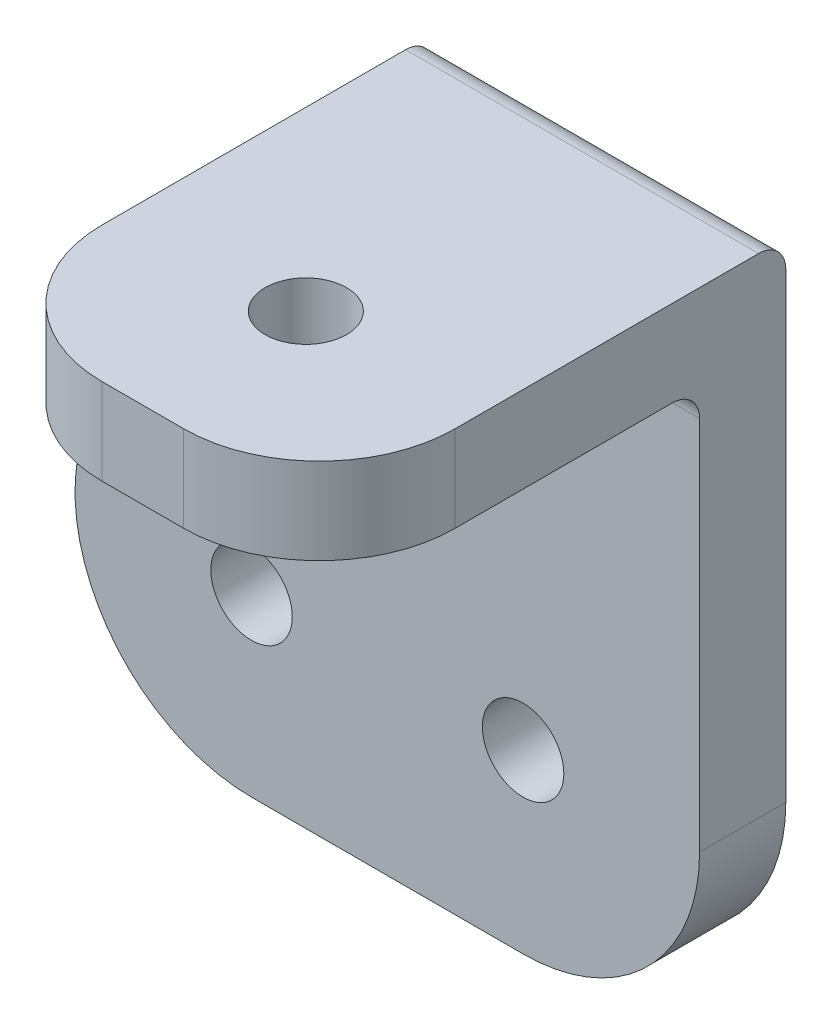
ISO-10303-21;
HEADER;
FILE_DESCRIPTION(('STEP AP214'),'2;1');
FILE_NAME('part.step','',(''),(''),'','','');
FILE_SCHEMA(('AUTOMOTIVE_DESIGN { 1 0 10303 214 1 1 1 1 }'));
ENDSEC;
DATA;
#1=APPLICATION_CONTEXT('core data for automotive mechanical design processes');
#2=APPLICATION_PROTOCOL_DEFINITION('international standard','automotive_design',2000,#1);
#3=PRODUCT_CONTEXT('',#1,'mechanical');
#4=PRODUCT('Part','Part','',(#3));
#5=PRODUCT_RELATED_PRODUCT_CATEGORY('part','',(#4));
#6=PRODUCT_DEFINITION_FORMATION('','',#4);
#7=PRODUCT_DEFINITION_CONTEXT('part definition',#1,'design');
#8=PRODUCT_DEFINITION('design','',#6,#7);
#9=PRODUCT_DEFINITION_SHAPE('','',#8);
#10=(LENGTH_UNIT() NAMED_UNIT(*) SI_UNIT(.MILLI.,.METRE.));
#11=(NAMED_UNIT(*) PLANE_ANGLE_UNIT() SI_UNIT($,.RADIAN.));
#12=(NAMED_UNIT(*) SI_UNIT($,.STERADIAN.) SOLID_ANGLE_UNIT());
#13=UNCERTAINTY_MEASURE_WITH_UNIT(LENGTH_MEASURE(1.E-05),#10,'distance_accuracy_value','');
#14=(GEOMETRIC_REPRESENTATION_CONTEXT(3) GLOBAL_UNCERTAINTY_ASSIGNED_CONTEXT((#13)) GLOBAL_UNIT_ASSIGNED_CONTEXT((#10,
#11,#12)) REPRESENTATION_CONTEXT('',''));
#15=CARTESIAN_POINT('',(0.,0.,0.));
#16=DIRECTION('',(0.,0.,1.));
#17=DIRECTION('',(1.,0.,0.));
#18=AXIS2_PLACEMENT_3D('',#15,#16,#17);
#19=CARTESIAN_POINT('',(0.,0.,3.175));
#20=DIRECTION('',(0.,0.,-1.));
#21=DIRECTION('',(-1.,0.,0.));
#22=AXIS2_PLACEMENT_3D('',#19,#20,#21);
#23=CYLINDRICAL_SURFACE('',#22,6.5);
#24=CARTESIAN_POINT('',(0.,0.,3.175));
#25=DIRECTION('',(0.,0.,1.));
#26=DIRECTION('',(1.,0.,0.));
#27=AXIS2_PLACEMENT_3D('',#24,#25,#26);
#28=CIRCLE('',#27,6.5);
#29=CARTESIAN_POINT('',(0.,-6.5,3.175));
#30=VERTEX_POINT('',#29);
#31=CARTESIAN_POINT('',(6.5,0.,3.175));
#32=VERTEX_POINT('',#31);
#33=EDGE_CURVE('E155',#30,#32,#28,.T.);
#34=ORIENTED_EDGE('',*,*,#33,.F.);
#35=DIRECTION('',(0.,0.,-1.));
#36=VECTOR('',#35,1.);
#37=CARTESIAN_POINT('',(0.,-6.5,24.1809515376));
#38=LINE('',#37,#36);
#39=CARTESIAN_POINT('',(0.,-6.5,0.));
#40=VERTEX_POINT('',#39);
#41=EDGE_CURVE('E139',#30,#40,#38,.T.);
#42=ORIENTED_EDGE('',*,*,#41,.T.);
#43=CARTESIAN_POINT('',(0.,0.,0.));
#44=DIRECTION('',(0.,0.,1.));
#45=DIRECTION('',(1.,0.,0.));
#46=AXIS2_PLACEMENT_3D('',#43,#44,#45);
#47=CIRCLE('',#46,6.5);
#48=CARTESIAN_POINT('',(6.5,0.,0.));
#49=VERTEX_POINT('',#48);
#50=EDGE_CURVE('E152',#40,#49,#47,.T.);
#51=ORIENTED_EDGE('',*,*,#50,.T.);
#52=DIRECTION('',(0.,0.,-1.));
#53=VECTOR('',#52,1.);
#54=CARTESIAN_POINT('',(6.5,0.,3.175));
#55=LINE('',#54,#53);
#56=EDGE_CURVE('E188',#32,#49,#55,.T.);
#57=ORIENTED_EDGE('',*,*,#56,.F.);
#58=EDGE_LOOP('',(#34,#42,#51,#57));
#59=FACE_BOUND('',#58,.T.);
#60=ADVANCED_FACE('F41',(#59),#23,.T.);
#61=CARTESIAN_POINT('',(6.5,0.,3.175));
#62=DIRECTION('',(1.,0.,0.));
#63=DIRECTION('',(0.,0.,-1.));
#64=AXIS2_PLACEMENT_3D('',#61,#62,#63);
#65=PLANE('',#64);
#66=DIRECTION('',(0.,-1.,0.));
#67=VECTOR('',#66,1.);
#68=CARTESIAN_POINT('',(6.5,0.,0.));
#69=LINE('',#68,#67);
#70=CARTESIAN_POINT('',(6.5,17.,0.));
#71=VERTEX_POINT('',#70);
#72=EDGE_CURVE('E163',#71,#49,#69,.T.);
#73=ORIENTED_EDGE('',*,*,#72,.F.);
#74=CARTESIAN_POINT('',(6.5,17.,1.));
#75=DIRECTION('',(1.,0.,0.));
#76=DIRECTION('',(0.,0.,-1.));
#77=AXIS2_PLACEMENT_3D('',#74,#75,#76);
#78=CIRCLE('',#77,1.);
#79=CARTESIAN_POINT('',(6.5,18.,1.));
#80=VERTEX_POINT('',#79);
#81=EDGE_CURVE('E226',#71,#80,#78,.T.);
#82=ORIENTED_EDGE('',*,*,#81,.T.);
#83=DIRECTION('',(0.,0.,-1.));
#84=VECTOR('',#83,1.);
#85=CARTESIAN_POINT('',(6.5,18.,3.175));
#86=LINE('',#85,#84);
#87=CARTESIAN_POINT('',(6.5,18.,12.175));
#88=VERTEX_POINT('',#87);
#89=EDGE_CURVE('E183',#88,#80,#86,.T.);
#90=ORIENTED_EDGE('',*,*,#89,.F.);
#91=DIRECTION('',(0.,1.,0.));
#92=VECTOR('',#91,1.);
#93=CARTESIAN_POINT('',(6.5,0.,12.175));
#94=LINE('',#93,#92);
#95=CARTESIAN_POINT('',(6.5,14.825,12.175));
#96=VERTEX_POINT('',#95);
#97=EDGE_CURVE('E220',#88,#96,#94,.F.);
#98=ORIENTED_EDGE('',*,*,#97,.T.);
#99=DIRECTION('',(0.,0.,-1.));
#100=VECTOR('',#99,1.);
#101=CARTESIAN_POINT('',(6.5,14.825,17.175));
#102=LINE('',#101,#100);
#103=CARTESIAN_POINT('',(6.5,14.825,4.175));
#104=VERTEX_POINT('',#103);
#105=EDGE_CURVE('E271',#96,#104,#102,.T.);
#106=ORIENTED_EDGE('',*,*,#105,.T.);
#107=CARTESIAN_POINT('',(6.5,13.825,4.175));
#108=DIRECTION('',(1.,0.,0.));
#109=DIRECTION('',(0.,0.,-1.));
#110=AXIS2_PLACEMENT_3D('',#107,#108,#109);
#111=CIRCLE('',#110,1.);
#112=CARTESIAN_POINT('',(6.5,13.825,3.175));
#113=VERTEX_POINT('',#112);
#114=EDGE_CURVE('E244',#104,#113,#111,.F.);
#115=ORIENTED_EDGE('',*,*,#114,.T.);
#116=DIRECTION('',(0.,-1.,0.));
#117=VECTOR('',#116,1.);
#118=CARTESIAN_POINT('',(6.5,0.,3.175));
#119=LINE('',#118,#117);
#120=EDGE_CURVE('E258',#113,#32,#119,.T.);
#121=ORIENTED_EDGE('',*,*,#120,.T.);
#122=ORIENTED_EDGE('',*,*,#56,.T.);
#123=EDGE_LOOP('',(#73,#82,#90,#98,#106,#115,#121,#122));
#124=FACE_BOUND('',#123,.T.);
#125=ADVANCED_FACE('F322',(#124),#65,.T.);
#126=CARTESIAN_POINT('',(0.,18.,3.175));
#127=DIRECTION('',(0.,1.,0.));
#128=DIRECTION('',(0.,0.,1.));
#129=AXIS2_PLACEMENT_3D('',#126,#127,#128);
#130=PLANE('',#129);
#131=CARTESIAN_POINT('',(0.,18.,11.175));
#132=DIRECTION('',(0.,1.,0.));
#133=DIRECTION('',(0.,0.,1.));
#134=AXIS2_PLACEMENT_3D('',#131,#132,#133);
#135=CIRCLE('',#134,1.5);
#136=CARTESIAN_POINT('',(0.,18.,12.675));
#137=VERTEX_POINT('',#136);
#138=EDGE_CURVE('E197',#137,#137,#135,.T.);
#139=ORIENTED_EDGE('',*,*,#138,.F.);
#140=EDGE_LOOP('',(#139));
#141=FACE_BOUND('',#140,.T.);
#142=ORIENTED_EDGE('',*,*,#89,.T.);
#143=DIRECTION('',(1.,0.,0.));
#144=VECTOR('',#143,1.);
#145=CARTESIAN_POINT('',(-6.5,18.,1.));
#146=LINE('',#145,#144);
#147=CARTESIAN_POINT('',(-6.5,18.,1.));
#148=VERTEX_POINT('',#147);
#149=EDGE_CURVE('E229',#80,#148,#146,.F.);
#150=ORIENTED_EDGE('',*,*,#149,.T.);
#151=DIRECTION('',(0.,0.,-1.));
#152=VECTOR('',#151,1.);
#153=CARTESIAN_POINT('',(-6.5,18.,3.175));
#154=LINE('',#153,#152);
#155=CARTESIAN_POINT('',(-6.5,18.,12.175));
#156=VERTEX_POINT('',#155);
#157=EDGE_CURVE('E179',#156,#148,#154,.T.);
#158=ORIENTED_EDGE('',*,*,#157,.F.);
#159=CARTESIAN_POINT('',(-1.5,18.,12.175));
#160=DIRECTION('',(0.,1.,0.));
#161=DIRECTION('',(0.,0.,1.));
#162=AXIS2_PLACEMENT_3D('',#159,#160,#161);
#163=CIRCLE('',#162,5.);
#164=CARTESIAN_POINT('',(-1.5,18.,17.175));
#165=VERTEX_POINT('',#164);
#166=EDGE_CURVE('E217',#156,#165,#163,.T.);
#167=ORIENTED_EDGE('',*,*,#166,.T.);
#168=DIRECTION('',(-1.,0.,0.));
#169=VECTOR('',#168,1.);
#170=CARTESIAN_POINT('',(-6.5,18.,17.175));
#171=LINE('',#170,#169);
#172=CARTESIAN_POINT('',(1.5,18.,17.175));
#173=VERTEX_POINT('',#172);
#174=EDGE_CURVE('E275',#173,#165,#171,.T.);
#175=ORIENTED_EDGE('',*,*,#174,.F.);
#176=CARTESIAN_POINT('',(1.5,18.,12.175));
#177=DIRECTION('',(0.,1.,0.));
#178=DIRECTION('',(0.,0.,1.));
#179=AXIS2_PLACEMENT_3D('',#176,#177,#178);
#180=CIRCLE('',#179,5.);
#181=EDGE_CURVE('E214',#173,#88,#180,.T.);
#182=ORIENTED_EDGE('',*,*,#181,.T.);
#183=EDGE_LOOP('',(#142,#150,#158,#167,#175,#182));
#184=FACE_BOUND('',#183,.T.);
#185=ADVANCED_FACE('F327',(#141,#184),#130,.T.);
#186=CARTESIAN_POINT('',(0.,0.,3.175));
#187=DIRECTION('',(0.,0.,-1.));
#188=DIRECTION('',(-1.,0.,0.));
#189=AXIS2_PLACEMENT_3D('',#186,#187,#188);
#190=CYLINDRICAL_SURFACE('',#189,1.5);
#191=CARTESIAN_POINT('',(0.,0.,3.175));
#192=DIRECTION('',(0.,0.,1.));
#193=DIRECTION('',(1.,0.,0.));
#194=AXIS2_PLACEMENT_3D('',#191,#192,#193);
#195=CIRCLE('',#194,1.5);
#196=CARTESIAN_POINT('',(1.5,0.,3.175));
#197=VERTEX_POINT('',#196);
#198=EDGE_CURVE('E178',#197,#197,#195,.T.);
#199=ORIENTED_EDGE('',*,*,#198,.T.);
#200=EDGE_LOOP('',(#199));
#201=FACE_BOUND('',#200,.T.);
#202=CARTESIAN_POINT('',(0.,0.,0.));
#203=DIRECTION('',(0.,0.,1.));
#204=DIRECTION('',(1.,0.,0.));
#205=AXIS2_PLACEMENT_3D('',#202,#203,#204);
#206=CIRCLE('',#205,1.5);
#207=CARTESIAN_POINT('',(1.5,0.,0.));
#208=VERTEX_POINT('',#207);
#209=EDGE_CURVE('E165',#208,#208,#206,.T.);
#210=ORIENTED_EDGE('',*,*,#209,.F.);
#211=EDGE_LOOP('',(#210));
#212=FACE_BOUND('',#211,.T.);
#213=ADVANCED_FACE('F332',(#201,#212),#190,.F.);
#214=CARTESIAN_POINT('',(-6.5,0.,3.175));
#215=DIRECTION('',(-1.,0.,0.));
#216=DIRECTION('',(0.,0.,1.));
#217=AXIS2_PLACEMENT_3D('',#214,#215,#216);
#218=PLANE('',#217);
#219=DIRECTION('',(0.,1.,0.));
#220=VECTOR('',#219,1.);
#221=CARTESIAN_POINT('',(-6.5,0.,0.));
#222=LINE('',#221,#220);
#223=CARTESIAN_POINT('',(-6.5,10.4772255750516,0.));
#224=VERTEX_POINT('',#223);
#225=CARTESIAN_POINT('',(-6.5,17.,0.));
#226=VERTEX_POINT('',#225);
#227=EDGE_CURVE('E169',#224,#226,#222,.T.);
#228=ORIENTED_EDGE('',*,*,#227,.F.);
#229=DIRECTION('',(0.,0.,1.));
#230=VECTOR('',#229,1.);
#231=CARTESIAN_POINT('',(-6.5,10.4772255750516,3.175));
#232=LINE('',#231,#230);
#233=CARTESIAN_POINT('',(-6.5,10.4772255750516,3.175));
#234=VERTEX_POINT('',#233);
#235=EDGE_CURVE('E57',#224,#234,#232,.T.);
#236=ORIENTED_EDGE('',*,*,#235,.T.);
#237=DIRECTION('',(0.,1.,0.));
#238=VECTOR('',#237,1.);
#239=CARTESIAN_POINT('',(-6.5,0.,3.175));
#240=LINE('',#239,#238);
#241=CARTESIAN_POINT('',(-6.5,13.825,3.175));
#242=VERTEX_POINT('',#241);
#243=EDGE_CURVE('E184',#234,#242,#240,.T.);
#244=ORIENTED_EDGE('',*,*,#243,.T.);
#245=CARTESIAN_POINT('',(-6.5,13.825,4.175));
#246=DIRECTION('',(-1.,0.,0.));
#247=DIRECTION('',(0.,0.,1.));
#248=AXIS2_PLACEMENT_3D('',#245,#246,#247);
#249=CIRCLE('',#248,1.);
#250=CARTESIAN_POINT('',(-6.5,14.825,4.175));
#251=VERTEX_POINT('',#250);
#252=EDGE_CURVE('E247',#242,#251,#249,.F.);
#253=ORIENTED_EDGE('',*,*,#252,.T.);
#254=DIRECTION('',(0.,0.,-1.));
#255=VECTOR('',#254,1.);
#256=CARTESIAN_POINT('',(-6.5,14.825,17.175));
#257=LINE('',#256,#255);
#258=CARTESIAN_POINT('',(-6.5,14.825,12.175));
#259=VERTEX_POINT('',#258);
#260=EDGE_CURVE('E172',#259,#251,#257,.T.);
#261=ORIENTED_EDGE('',*,*,#260,.F.);
#262=DIRECTION('',(0.,-1.,0.));
#263=VECTOR('',#262,1.);
#264=CARTESIAN_POINT('',(-6.5,0.,12.175));
#265=LINE('',#264,#263);
#266=EDGE_CURVE('E211',#259,#156,#265,.F.);
#267=ORIENTED_EDGE('',*,*,#266,.T.);
#268=ORIENTED_EDGE('',*,*,#157,.T.);
#269=CARTESIAN_POINT('',(-6.5,17.,1.));
#270=DIRECTION('',(-1.,0.,0.));
#271=DIRECTION('',(0.,0.,1.));
#272=AXIS2_PLACEMENT_3D('',#269,#270,#271);
#273=CIRCLE('',#272,1.);
#274=EDGE_CURVE('E232',#148,#226,#273,.T.);
#275=ORIENTED_EDGE('',*,*,#274,.T.);
#276=EDGE_LOOP('',(#228,#236,#244,#253,#261,#267,#268,#275));
#277=FACE_BOUND('',#276,.T.);
#278=ADVANCED_FACE('F317',(#277),#218,.T.);
#279=CARTESIAN_POINT('',(0.,0.,3.175));
#280=DIRECTION('',(0.,0.,1.));
#281=DIRECTION('',(1.,0.,0.));
#282=AXIS2_PLACEMENT_3D('',#279,#280,#281);
#283=PLANE('',#282);
#284=ORIENTED_EDGE('',*,*,#120,.F.);
#285=DIRECTION('',(1.,0.,0.));
#286=VECTOR('',#285,1.);
#287=CARTESIAN_POINT('',(0.,13.825,3.175));
#288=LINE('',#287,#286);
#289=EDGE_CURVE('E240',#113,#242,#288,.F.);
#290=ORIENTED_EDGE('',*,*,#289,.T.);
#291=ORIENTED_EDGE('',*,*,#243,.F.);
#292=DIRECTION('',(-0.707106781186552,-0.707106781186544,0.));
#293=VECTOR('',#292,1.);
#294=CARTESIAN_POINT('',(-10.4961922257212,6.48103334933047,3.175));
#295=LINE('',#294,#293);
#296=CARTESIAN_POINT('',(-10.4961922257212,6.48103334933047,3.175));
#297=VERTEX_POINT('',#296);
#298=EDGE_CURVE('E11',#234,#297,#295,.T.);
#299=ORIENTED_EDGE('',*,*,#298,.T.);
#300=CARTESIAN_POINT('',(-10.,0.,3.175));
#301=DIRECTION('',(0.,0.,1.));
#302=DIRECTION('',(1.,0.,0.));
#303=AXIS2_PLACEMENT_3D('',#300,#301,#302);
#304=CIRCLE('',#303,6.5);
#305=CARTESIAN_POINT('',(-10.,-6.5,3.175));
#306=VERTEX_POINT('',#305);
#307=EDGE_CURVE('E157',#306,#297,#304,.F.);
#308=ORIENTED_EDGE('',*,*,#307,.F.);
#309=DIRECTION('',(-1.,0.,0.));
#310=VECTOR('',#309,1.);
#311=CARTESIAN_POINT('',(0.,-6.5,3.175));
#312=LINE('',#311,#310);
#313=EDGE_CURVE('E287',#30,#306,#312,.T.);
#314=ORIENTED_EDGE('',*,*,#313,.F.);
#315=ORIENTED_EDGE('',*,*,#33,.T.);
#316=EDGE_LOOP('',(#284,#290,#291,#299,#308,#314,#315));
#317=FACE_BOUND('',#316,.T.);
#318=ORIENTED_EDGE('',*,*,#198,.F.);
#319=EDGE_LOOP('',(#318));
#320=FACE_BOUND('',#319,.T.);
#321=CARTESIAN_POINT('',(-10.,0.,3.175));
#322=DIRECTION('',(0.,0.,1.));
#323=DIRECTION('',(1.,0.,0.));
#324=AXIS2_PLACEMENT_3D('',#321,#322,#323);
#325=CIRCLE('',#324,1.5);
#326=CARTESIAN_POINT('',(-8.5,0.,3.175));
#327=VERTEX_POINT('',#326);
#328=EDGE_CURVE('E285',#327,#327,#325,.F.);
#329=ORIENTED_EDGE('',*,*,#328,.T.);
#330=EDGE_LOOP('',(#329));
#331=FACE_BOUND('',#330,.T.);
#332=ADVANCED_FACE('F308',(#317,#320,#331),#283,.T.);
#333=CARTESIAN_POINT('',(0.,0.,0.));
#334=DIRECTION('',(0.,0.,1.));
#335=DIRECTION('',(1.,0.,0.));
#336=AXIS2_PLACEMENT_3D('',#333,#334,#335);
#337=PLANE('',#336);
#338=CARTESIAN_POINT('',(-10.,0.,0.));
#339=DIRECTION('',(0.,0.,-1.));
#340=DIRECTION('',(-1.,0.,0.));
#341=AXIS2_PLACEMENT_3D('',#338,#339,#340);
#342=CIRCLE('',#341,6.5);
#343=CARTESIAN_POINT('',(-10.,-6.5,0.));
#344=VERTEX_POINT('',#343);
#345=CARTESIAN_POINT('',(-10.4961922257212,6.48103334933047,0.));
#346=VERTEX_POINT('',#345);
#347=EDGE_CURVE('E146',#344,#346,#342,.T.);
#348=ORIENTED_EDGE('',*,*,#347,.T.);
#349=DIRECTION('',(0.707106781186552,0.707106781186544,0.));
#350=VECTOR('',#349,1.);
#351=CARTESIAN_POINT('',(-8.48861278752578,8.48861278752588,0.));
#352=LINE('',#351,#350);
#353=EDGE_CURVE('E50',#346,#224,#352,.T.);
#354=ORIENTED_EDGE('',*,*,#353,.T.);
#355=ORIENTED_EDGE('',*,*,#227,.T.);
#356=DIRECTION('',(1.,0.,0.));
#357=VECTOR('',#356,1.);
#358=CARTESIAN_POINT('',(6.5,17.,0.));
#359=LINE('',#358,#357);
#360=EDGE_CURVE('E223',#226,#71,#359,.T.);
#361=ORIENTED_EDGE('',*,*,#360,.T.);
#362=ORIENTED_EDGE('',*,*,#72,.T.);
#363=ORIENTED_EDGE('',*,*,#50,.F.);
#364=DIRECTION('',(-1.,0.,0.));
#365=VECTOR('',#364,1.);
#366=CARTESIAN_POINT('',(0.,-6.5,0.));
#367=LINE('',#366,#365);
#368=EDGE_CURVE('E135',#40,#344,#367,.T.);
#369=ORIENTED_EDGE('',*,*,#368,.T.);
#370=EDGE_LOOP('',(#348,#354,#355,#361,#362,#363,#369));
#371=FACE_BOUND('',#370,.T.);
#372=ORIENTED_EDGE('',*,*,#209,.T.);
#373=EDGE_LOOP('',(#372));
#374=FACE_BOUND('',#373,.T.);
#375=CARTESIAN_POINT('',(-10.,0.,0.));
#376=DIRECTION('',(0.,0.,-1.));
#377=DIRECTION('',(-1.,0.,0.));
#378=AXIS2_PLACEMENT_3D('',#375,#376,#377);
#379=CIRCLE('',#378,1.5);
#380=CARTESIAN_POINT('',(-11.5,0.,0.));
#381=VERTEX_POINT('',#380);
#382=EDGE_CURVE('E147',#381,#381,#379,.T.);
#383=ORIENTED_EDGE('',*,*,#382,.F.);
#384=EDGE_LOOP('',(#383));
#385=FACE_BOUND('',#384,.T.);
#386=ADVANCED_FACE('F159',(#371,#374,#385),#337,.F.);
#387=CARTESIAN_POINT('',(-6.5,14.825,17.175));
#388=DIRECTION('',(0.,1.,0.));
#389=DIRECTION('',(0.,0.,1.));
#390=AXIS2_PLACEMENT_3D('',#387,#388,#389);
#391=PLANE('',#390);
#392=CARTESIAN_POINT('',(0.,14.825,11.175));
#393=DIRECTION('',(0.,1.,0.));
#394=DIRECTION('',(0.,0.,1.));
#395=AXIS2_PLACEMENT_3D('',#392,#393,#394);
#396=CIRCLE('',#395,1.5);
#397=CARTESIAN_POINT('',(0.,14.825,12.675));
#398=VERTEX_POINT('',#397);
#399=EDGE_CURVE('E192',#398,#398,#396,.T.);
#400=ORIENTED_EDGE('',*,*,#399,.T.);
#401=EDGE_LOOP('',(#400));
#402=FACE_BOUND('',#401,.T.);
#403=ORIENTED_EDGE('',*,*,#260,.T.);
#404=DIRECTION('',(1.,0.,0.));
#405=VECTOR('',#404,1.);
#406=CARTESIAN_POINT('',(-6.5,14.825,4.175));
#407=LINE('',#406,#405);
#408=EDGE_CURVE('E236',#251,#104,#407,.T.);
#409=ORIENTED_EDGE('',*,*,#408,.T.);
#410=ORIENTED_EDGE('',*,*,#105,.F.);
#411=CARTESIAN_POINT('',(1.5,14.825,12.175));
#412=DIRECTION('',(0.,1.,0.));
#413=DIRECTION('',(0.,0.,1.));
#414=AXIS2_PLACEMENT_3D('',#411,#412,#413);
#415=CIRCLE('',#414,5.);
#416=CARTESIAN_POINT('',(1.5,14.825,17.175));
#417=VERTEX_POINT('',#416);
#418=EDGE_CURVE('E205',#96,#417,#415,.F.);
#419=ORIENTED_EDGE('',*,*,#418,.T.);
#420=DIRECTION('',(1.,0.,0.));
#421=VECTOR('',#420,1.);
#422=CARTESIAN_POINT('',(-6.5,14.825,17.175));
#423=LINE('',#422,#421);
#424=CARTESIAN_POINT('',(-1.5,14.825,17.175));
#425=VERTEX_POINT('',#424);
#426=EDGE_CURVE('E196',#425,#417,#423,.T.);
#427=ORIENTED_EDGE('',*,*,#426,.F.);
#428=CARTESIAN_POINT('',(-1.5,14.825,12.175));
#429=DIRECTION('',(0.,1.,0.));
#430=DIRECTION('',(0.,0.,1.));
#431=AXIS2_PLACEMENT_3D('',#428,#429,#430);
#432=CIRCLE('',#431,5.);
#433=EDGE_CURVE('E208',#425,#259,#432,.F.);
#434=ORIENTED_EDGE('',*,*,#433,.T.);
#435=EDGE_LOOP('',(#403,#409,#410,#419,#427,#434));
#436=FACE_BOUND('',#435,.T.);
#437=ADVANCED_FACE('F307',(#402,#436),#391,.F.);
#438=CARTESIAN_POINT('',(0.,0.,17.175));
#439=DIRECTION('',(0.,0.,1.));
#440=DIRECTION('',(1.,0.,0.));
#441=AXIS2_PLACEMENT_3D('',#438,#439,#440);
#442=PLANE('',#441);
#443=ORIENTED_EDGE('',*,*,#174,.T.);
#444=DIRECTION('',(0.,-1.,0.));
#445=VECTOR('',#444,1.);
#446=CARTESIAN_POINT('',(-1.5,0.,17.175));
#447=LINE('',#446,#445);
#448=EDGE_CURVE('E201',#165,#425,#447,.T.);
#449=ORIENTED_EDGE('',*,*,#448,.T.);
#450=ORIENTED_EDGE('',*,*,#426,.T.);
#451=DIRECTION('',(0.,1.,0.));
#452=VECTOR('',#451,1.);
#453=CARTESIAN_POINT('',(1.5,0.,17.175));
#454=LINE('',#453,#452);
#455=EDGE_CURVE('E191',#417,#173,#454,.T.);
#456=ORIENTED_EDGE('',*,*,#455,.T.);
#457=EDGE_LOOP('',(#443,#449,#450,#456));
#458=FACE_BOUND('',#457,.T.);
#459=ADVANCED_FACE('F314',(#458),#442,.T.);
#460=CARTESIAN_POINT('',(0.,0.,11.175));
#461=DIRECTION('',(0.,1.,0.));
#462=DIRECTION('',(0.,0.,1.));
#463=AXIS2_PLACEMENT_3D('',#460,#461,#462);
#464=CYLINDRICAL_SURFACE('',#463,1.5);
#465=ORIENTED_EDGE('',*,*,#138,.T.);
#466=EDGE_LOOP('',(#465));
#467=FACE_BOUND('',#466,.T.);
#468=ORIENTED_EDGE('',*,*,#399,.F.);
#469=EDGE_LOOP('',(#468));
#470=FACE_BOUND('',#469,.T.);
#471=ADVANCED_FACE('F339',(#467,#470),#464,.F.);
#472=CARTESIAN_POINT('',(-1.5,0.,12.175));
#473=DIRECTION('',(0.,-1.,0.));
#474=DIRECTION('',(0.,0.,-1.));
#475=AXIS2_PLACEMENT_3D('',#472,#473,#474);
#476=CYLINDRICAL_SURFACE('',#475,5.);
#477=ORIENTED_EDGE('',*,*,#166,.F.);
#478=ORIENTED_EDGE('',*,*,#266,.F.);
#479=ORIENTED_EDGE('',*,*,#433,.F.);
#480=ORIENTED_EDGE('',*,*,#448,.F.);
#481=EDGE_LOOP('',(#477,#478,#479,#480));
#482=FACE_BOUND('',#481,.T.);
#483=ADVANCED_FACE('F335',(#482),#476,.T.);
#484=CARTESIAN_POINT('',(1.5,0.,12.175));
#485=DIRECTION('',(0.,1.,0.));
#486=DIRECTION('',(0.,0.,1.));
#487=AXIS2_PLACEMENT_3D('',#484,#485,#486);
#488=CYLINDRICAL_SURFACE('',#487,5.);
#489=ORIENTED_EDGE('',*,*,#418,.F.);
#490=ORIENTED_EDGE('',*,*,#97,.F.);
#491=ORIENTED_EDGE('',*,*,#181,.F.);
#492=ORIENTED_EDGE('',*,*,#455,.F.);
#493=EDGE_LOOP('',(#489,#490,#491,#492));
#494=FACE_BOUND('',#493,.T.);
#495=ADVANCED_FACE('F338',(#494),#488,.T.);
#496=CARTESIAN_POINT('',(0.,-6.5,24.1809515376));
#497=DIRECTION('',(0.,-1.,0.));
#498=DIRECTION('',(0.,0.,-1.));
#499=AXIS2_PLACEMENT_3D('',#496,#497,#498);
#500=PLANE('',#499);
#501=ORIENTED_EDGE('',*,*,#41,.F.);
#502=ORIENTED_EDGE('',*,*,#313,.T.);
#503=DIRECTION('',(0.,0.,-1.));
#504=VECTOR('',#503,1.);
#505=CARTESIAN_POINT('',(-10.,-6.5,24.1809515376));
#506=LINE('',#505,#504);
#507=EDGE_CURVE('E142',#306,#344,#506,.T.);
#508=ORIENTED_EDGE('',*,*,#507,.T.);
#509=ORIENTED_EDGE('',*,*,#368,.F.);
#510=EDGE_LOOP('',(#501,#502,#508,#509));
#511=FACE_BOUND('',#510,.T.);
#512=ADVANCED_FACE('F137',(#511),#500,.T.);
#513=CARTESIAN_POINT('',(-10.,0.,24.1809515376));
#514=DIRECTION('',(0.,0.,-1.));
#515=DIRECTION('',(-1.,0.,0.));
#516=AXIS2_PLACEMENT_3D('',#513,#514,#515);
#517=CYLINDRICAL_SURFACE('',#516,6.5);
#518=ORIENTED_EDGE('',*,*,#307,.T.);
#519=DIRECTION('',(0.,0.,-1.));
#520=VECTOR('',#519,1.);
#521=CARTESIAN_POINT('',(-10.4961922257212,6.48103334933047,24.1809515376));
#522=LINE('',#521,#520);
#523=EDGE_CURVE('E250',#297,#346,#522,.T.);
#524=ORIENTED_EDGE('',*,*,#523,.T.);
#525=ORIENTED_EDGE('',*,*,#347,.F.);
#526=ORIENTED_EDGE('',*,*,#507,.F.);
#527=EDGE_LOOP('',(#518,#524,#525,#526));
#528=FACE_BOUND('',#527,.T.);
#529=ADVANCED_FACE('F376',(#528),#517,.T.);
#530=CARTESIAN_POINT('',(-10.,0.,24.1809515376));
#531=DIRECTION('',(0.,0.,-1.));
#532=DIRECTION('',(-1.,0.,0.));
#533=AXIS2_PLACEMENT_3D('',#530,#531,#532);
#534=CYLINDRICAL_SURFACE('',#533,1.5);
#535=ORIENTED_EDGE('',*,*,#382,.T.);
#536=EDGE_LOOP('',(#535));
#537=FACE_BOUND('',#536,.T.);
#538=ORIENTED_EDGE('',*,*,#328,.F.);
#539=EDGE_LOOP('',(#538));
#540=FACE_BOUND('',#539,.T.);
#541=ADVANCED_FACE('F303',(#537,#540),#534,.F.);
#542=CARTESIAN_POINT('',(0.,17.,1.));
#543=DIRECTION('',(-1.,0.,0.));
#544=DIRECTION('',(0.,0.,1.));
#545=AXIS2_PLACEMENT_3D('',#542,#543,#544);
#546=CYLINDRICAL_SURFACE('',#545,1.);
#547=ORIENTED_EDGE('',*,*,#274,.F.);
#548=ORIENTED_EDGE('',*,*,#149,.F.);
#549=ORIENTED_EDGE('',*,*,#81,.F.);
#550=ORIENTED_EDGE('',*,*,#360,.F.);
#551=EDGE_LOOP('',(#547,#548,#549,#550));
#552=FACE_BOUND('',#551,.T.);
#553=ADVANCED_FACE('F344',(#552),#546,.T.);
#554=CARTESIAN_POINT('',(-6.5,13.825,4.175));
#555=DIRECTION('',(1.,0.,0.));
#556=DIRECTION('',(0.,0.,-1.));
#557=AXIS2_PLACEMENT_3D('',#554,#555,#556);
#558=CYLINDRICAL_SURFACE('',#557,1.);
#559=ORIENTED_EDGE('',*,*,#252,.F.);
#560=ORIENTED_EDGE('',*,*,#289,.F.);
#561=ORIENTED_EDGE('',*,*,#114,.F.);
#562=ORIENTED_EDGE('',*,*,#408,.F.);
#563=EDGE_LOOP('',(#559,#560,#561,#562));
#564=FACE_BOUND('',#563,.T.);
#565=ADVANCED_FACE('F346',(#564),#558,.F.);
#566=CARTESIAN_POINT('',(-10.4961922257212,6.48103334933047,24.1809515376));
#567=DIRECTION('',(0.707106781186544,-0.707106781186552,0.));
#568=DIRECTION('',(0.,0.,-1.));
#569=AXIS2_PLACEMENT_3D('',#566,#567,#568);
#570=PLANE('',#569);
#571=ORIENTED_EDGE('',*,*,#298,.F.);
#572=ORIENTED_EDGE('',*,*,#235,.F.);
#573=ORIENTED_EDGE('',*,*,#353,.F.);
#574=ORIENTED_EDGE('',*,*,#523,.F.);
#575=EDGE_LOOP('',(#571,#572,#573,#574));
#576=FACE_BOUND('',#575,.T.);
#577=ADVANCED_FACE('F43',(#576),#570,.F.);
#578=CLOSED_SHELL('',(#60,#125,#185,#213,#278,#332,#386,#437,#459,#471,#483,#495,#512,#529,#541,
#553,#565,#577));
#579=MANIFOLD_SOLID_BREP('B2',#578);
#580=ADVANCED_BREP_SHAPE_REPRESENTATION('',(#18,#579),#14);
#581=SHAPE_DEFINITION_REPRESENTATION(#9,#580);
ENDSEC;
END-ISO-10303-21;
